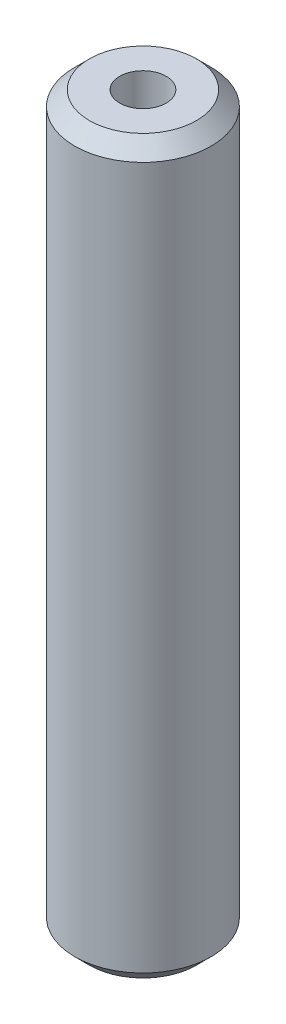
ISO-10303-21;
HEADER;
FILE_DESCRIPTION(('STEP AP214'),'2;1');
FILE_NAME('part.step','',(''),(''),'','','');
FILE_SCHEMA(('AUTOMOTIVE_DESIGN { 1 0 10303 214 1 1 1 1 }'));
ENDSEC;
DATA;
#1=APPLICATION_CONTEXT('core data for automotive mechanical design processes');
#2=APPLICATION_PROTOCOL_DEFINITION('international standard','automotive_design',2000,#1);
#3=PRODUCT_CONTEXT('',#1,'mechanical');
#4=PRODUCT('Part','Part','',(#3));
#5=PRODUCT_RELATED_PRODUCT_CATEGORY('part','',(#4));
#6=PRODUCT_DEFINITION_FORMATION('','',#4);
#7=PRODUCT_DEFINITION_CONTEXT('part definition',#1,'design');
#8=PRODUCT_DEFINITION('design','',#6,#7);
#9=PRODUCT_DEFINITION_SHAPE('','',#8);
#10=(LENGTH_UNIT() NAMED_UNIT(*) SI_UNIT(.MILLI.,.METRE.));
#11=(NAMED_UNIT(*) PLANE_ANGLE_UNIT() SI_UNIT($,.RADIAN.));
#12=(NAMED_UNIT(*) SI_UNIT($,.STERADIAN.) SOLID_ANGLE_UNIT());
#13=UNCERTAINTY_MEASURE_WITH_UNIT(LENGTH_MEASURE(1.E-05),#10,'distance_accuracy_value','');
#14=(GEOMETRIC_REPRESENTATION_CONTEXT(3) GLOBAL_UNCERTAINTY_ASSIGNED_CONTEXT((#13)) GLOBAL_UNIT_ASSIGNED_CONTEXT((#10,
#11,#12)) REPRESENTATION_CONTEXT('',''));
#15=CARTESIAN_POINT('',(0.,0.,0.));
#16=DIRECTION('',(0.,0.,1.));
#17=DIRECTION('',(1.,0.,0.));
#18=AXIS2_PLACEMENT_3D('',#15,#16,#17);
#19=CARTESIAN_POINT('',(0.,107.185138911312,0.));
#20=DIRECTION('',(0.,-1.,0.));
#21=DIRECTION('',(0.,0.,-1.));
#22=AXIS2_PLACEMENT_3D('',#19,#20,#21);
#23=CYLINDRICAL_SURFACE('',#22,10.);
#24=CARTESIAN_POINT('',(0.,105.027769165865,0.));
#25=DIRECTION('',(0.,1.,0.));
#26=DIRECTION('',(0.,0.,1.));
#27=AXIS2_PLACEMENT_3D('',#24,#25,#26);
#28=CIRCLE('',#27,10.);
#29=CARTESIAN_POINT('',(0.,105.027769165865,10.));
#30=VERTEX_POINT('',#29);
#31=EDGE_CURVE('E50',#30,#30,#28,.F.);
#32=ORIENTED_EDGE('',*,*,#31,.T.);
#33=EDGE_LOOP('',(#32));
#34=FACE_BOUND('',#33,.T.);
#35=CARTESIAN_POINT('',(0.,2.15736974544738,0.));
#36=DIRECTION('',(0.,1.,0.));
#37=DIRECTION('',(0.,0.,1.));
#38=AXIS2_PLACEMENT_3D('',#35,#36,#37);
#39=CIRCLE('',#38,10.);
#40=CARTESIAN_POINT('',(0.,2.15736974544738,10.));
#41=VERTEX_POINT('',#40);
#42=EDGE_CURVE('E51',#41,#41,#39,.T.);
#43=ORIENTED_EDGE('',*,*,#42,.T.);
#44=EDGE_LOOP('',(#43));
#45=FACE_BOUND('',#44,.T.);
#46=ADVANCED_FACE('F39',(#34,#45),#23,.T.);
#47=CARTESIAN_POINT('',(0.,107.185138911312,0.));
#48=DIRECTION('',(0.,1.,0.));
#49=DIRECTION('',(0.,0.,1.));
#50=AXIS2_PLACEMENT_3D('',#47,#48,#49);
#51=PLANE('',#50);
#52=CARTESIAN_POINT('',(0.,107.185138911312,0.));
#53=DIRECTION('',(0.,1.,0.));
#54=DIRECTION('',(0.,0.,1.));
#55=AXIS2_PLACEMENT_3D('',#52,#53,#54);
#56=CIRCLE('',#55,7.84263025455262);
#57=CARTESIAN_POINT('',(0.,107.185138911312,7.84263025455262));
#58=VERTEX_POINT('',#57);
#59=EDGE_CURVE('E54',#58,#58,#56,.T.);
#60=ORIENTED_EDGE('',*,*,#59,.T.);
#61=EDGE_LOOP('',(#60));
#62=FACE_BOUND('',#61,.T.);
#63=CARTESIAN_POINT('',(0.,107.185138911312,0.));
#64=DIRECTION('',(0.,1.,0.));
#65=DIRECTION('',(0.,0.,1.));
#66=AXIS2_PLACEMENT_3D('',#63,#64,#65);
#67=CIRCLE('',#66,3.40942066981803);
#68=CARTESIAN_POINT('',(0.,107.185138911312,3.40942066981803));
#69=VERTEX_POINT('',#68);
#70=EDGE_CURVE('E58',#69,#69,#67,.T.);
#71=ORIENTED_EDGE('',*,*,#70,.F.);
#72=EDGE_LOOP('',(#71));
#73=FACE_BOUND('',#72,.T.);
#74=ADVANCED_FACE('F69',(#62,#73),#51,.T.);
#75=CARTESIAN_POINT('',(0.,0.,0.));
#76=DIRECTION('',(0.,1.,0.));
#77=DIRECTION('',(0.,0.,1.));
#78=AXIS2_PLACEMENT_3D('',#75,#76,#77);
#79=PLANE('',#78);
#80=CARTESIAN_POINT('',(0.,0.,0.));
#81=DIRECTION('',(0.,1.,0.));
#82=DIRECTION('',(0.,0.,1.));
#83=AXIS2_PLACEMENT_3D('',#80,#81,#82);
#84=CIRCLE('',#83,7.8426302545526);
#85=CARTESIAN_POINT('',(0.,0.,7.8426302545526));
#86=VERTEX_POINT('',#85);
#87=EDGE_CURVE('E10',#86,#86,#84,.F.);
#88=ORIENTED_EDGE('',*,*,#87,.T.);
#89=EDGE_LOOP('',(#88));
#90=FACE_BOUND('',#89,.T.);
#91=CARTESIAN_POINT('',(0.,0.,0.));
#92=DIRECTION('',(0.,1.,0.));
#93=DIRECTION('',(0.,0.,1.));
#94=AXIS2_PLACEMENT_3D('',#91,#92,#93);
#95=CIRCLE('',#94,3.40942066981803);
#96=CARTESIAN_POINT('',(0.,0.,3.40942066981803));
#97=VERTEX_POINT('',#96);
#98=EDGE_CURVE('E63',#97,#97,#95,.T.);
#99=ORIENTED_EDGE('',*,*,#98,.T.);
#100=EDGE_LOOP('',(#99));
#101=FACE_BOUND('',#100,.T.);
#102=ADVANCED_FACE('F75',(#90,#101),#79,.F.);
#103=CARTESIAN_POINT('',(0.,107.185138911312,0.));
#104=DIRECTION('',(0.,-1.,0.));
#105=DIRECTION('',(0.,0.,-1.));
#106=AXIS2_PLACEMENT_3D('',#103,#104,#105);
#107=CYLINDRICAL_SURFACE('',#106,3.40942066981803);
#108=ORIENTED_EDGE('',*,*,#70,.T.);
#109=EDGE_LOOP('',(#108));
#110=FACE_BOUND('',#109,.T.);
#111=ORIENTED_EDGE('',*,*,#98,.F.);
#112=EDGE_LOOP('',(#111));
#113=FACE_BOUND('',#112,.T.);
#114=ADVANCED_FACE('F70',(#110,#113),#107,.F.);
#115=CARTESIAN_POINT('',(0.,107.185138911312,0.));
#116=DIRECTION('',(0.,-1.,0.));
#117=DIRECTION('',(0.,0.,-1.));
#118=AXIS2_PLACEMENT_3D('',#115,#116,#117);
#119=CONICAL_SURFACE('',#118,7.84263025455262,0.785398163397446);
#120=ORIENTED_EDGE('',*,*,#31,.F.);
#121=EDGE_LOOP('',(#120));
#122=FACE_BOUND('',#121,.T.);
#123=ORIENTED_EDGE('',*,*,#59,.F.);
#124=EDGE_LOOP('',(#123));
#125=FACE_BOUND('',#124,.T.);
#126=ADVANCED_FACE('F81',(#122,#125),#119,.T.);
#127=CARTESIAN_POINT('',(0.,2.15736974544738,0.));
#128=DIRECTION('',(0.,1.,0.));
#129=DIRECTION('',(0.,0.,1.));
#130=AXIS2_PLACEMENT_3D('',#127,#128,#129);
#131=CONICAL_SURFACE('',#130,10.,0.785398163397453);
#132=ORIENTED_EDGE('',*,*,#87,.F.);
#133=EDGE_LOOP('',(#132));
#134=FACE_BOUND('',#133,.T.);
#135=ORIENTED_EDGE('',*,*,#42,.F.);
#136=EDGE_LOOP('',(#135));
#137=FACE_BOUND('',#136,.T.);
#138=ADVANCED_FACE('F45',(#134,#137),#131,.T.);
#139=CLOSED_SHELL('',(#46,#74,#102,#114,#126,#138));
#140=MANIFOLD_SOLID_BREP('B2',#139);
#141=ADVANCED_BREP_SHAPE_REPRESENTATION('',(#18,#140),#14);
#142=SHAPE_DEFINITION_REPRESENTATION(#9,#141);
ENDSEC;
END-ISO-10303-21;
